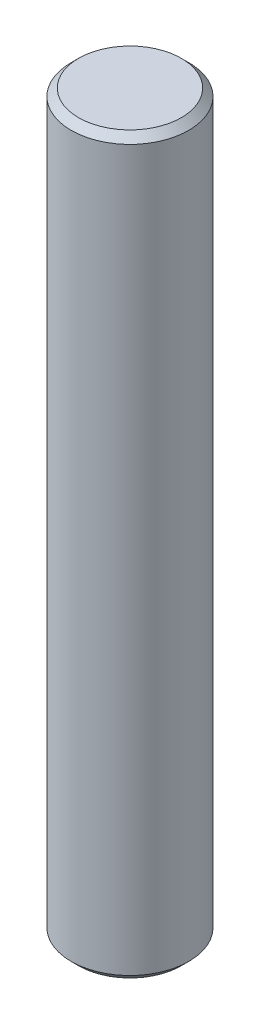
ISO-10303-21;
HEADER;
FILE_DESCRIPTION(('STEP AP214'),'2;1');
FILE_NAME('part.step','',(''),(''),'','','');
FILE_SCHEMA(('AUTOMOTIVE_DESIGN { 1 0 10303 214 1 1 1 1 }'));
ENDSEC;
DATA;
#1=APPLICATION_CONTEXT('core data for automotive mechanical design processes');
#2=APPLICATION_PROTOCOL_DEFINITION('international standard','automotive_design',2000,#1);
#3=PRODUCT_CONTEXT('',#1,'mechanical');
#4=PRODUCT('Part','Part','',(#3));
#5=PRODUCT_RELATED_PRODUCT_CATEGORY('part','',(#4));
#6=PRODUCT_DEFINITION_FORMATION('','',#4);
#7=PRODUCT_DEFINITION_CONTEXT('part definition',#1,'design');
#8=PRODUCT_DEFINITION('design','',#6,#7);
#9=PRODUCT_DEFINITION_SHAPE('','',#8);
#10=(LENGTH_UNIT() NAMED_UNIT(*) SI_UNIT(.MILLI.,.METRE.));
#11=(NAMED_UNIT(*) PLANE_ANGLE_UNIT() SI_UNIT($,.RADIAN.));
#12=(NAMED_UNIT(*) SI_UNIT($,.STERADIAN.) SOLID_ANGLE_UNIT());
#13=UNCERTAINTY_MEASURE_WITH_UNIT(LENGTH_MEASURE(1.E-05),#10,'distance_accuracy_value','');
#14=(GEOMETRIC_REPRESENTATION_CONTEXT(3) GLOBAL_UNCERTAINTY_ASSIGNED_CONTEXT((#13)) GLOBAL_UNIT_ASSIGNED_CONTEXT((#10,
#11,#12)) REPRESENTATION_CONTEXT('',''));
#15=CARTESIAN_POINT('',(0.,0.,0.));
#16=DIRECTION('',(0.,0.,1.));
#17=DIRECTION('',(1.,0.,0.));
#18=AXIS2_PLACEMENT_3D('',#15,#16,#17);
#19=CARTESIAN_POINT('',(0.,50.,0.));
#20=DIRECTION('',(0.,-1.,0.));
#21=DIRECTION('',(0.,0.,-1.));
#22=AXIS2_PLACEMENT_3D('',#19,#20,#21);
#23=CYLINDRICAL_SURFACE('',#22,4.);
#24=CARTESIAN_POINT('',(0.,0.499999999999987,0.));
#25=DIRECTION('',(0.,1.,0.));
#26=DIRECTION('',(0.,0.,1.));
#27=AXIS2_PLACEMENT_3D('',#24,#25,#26);
#28=CIRCLE('',#27,4.);
#29=CARTESIAN_POINT('',(0.,0.499999999999987,4.));
#30=VERTEX_POINT('',#29);
#31=EDGE_CURVE('E41',#30,#30,#28,.T.);
#32=ORIENTED_EDGE('',*,*,#31,.T.);
#33=EDGE_LOOP('',(#32));
#34=FACE_BOUND('',#33,.T.);
#35=CARTESIAN_POINT('',(0.,49.5,0.));
#36=DIRECTION('',(0.,1.,0.));
#37=DIRECTION('',(0.,0.,1.));
#38=AXIS2_PLACEMENT_3D('',#35,#36,#37);
#39=CIRCLE('',#38,4.);
#40=CARTESIAN_POINT('',(0.,49.5,4.));
#41=VERTEX_POINT('',#40);
#42=EDGE_CURVE('E45',#41,#41,#39,.F.);
#43=ORIENTED_EDGE('',*,*,#42,.T.);
#44=EDGE_LOOP('',(#43));
#45=FACE_BOUND('',#44,.T.);
#46=ADVANCED_FACE('F30',(#34,#45),#23,.T.);
#47=CARTESIAN_POINT('',(0.,50.,0.));
#48=DIRECTION('',(0.,1.,0.));
#49=DIRECTION('',(0.,0.,1.));
#50=AXIS2_PLACEMENT_3D('',#47,#48,#49);
#51=PLANE('',#50);
#52=CARTESIAN_POINT('',(0.,50.,0.));
#53=DIRECTION('',(0.,1.,0.));
#54=DIRECTION('',(0.,0.,1.));
#55=AXIS2_PLACEMENT_3D('',#52,#53,#54);
#56=CIRCLE('',#55,3.5);
#57=CARTESIAN_POINT('',(0.,50.,3.5));
#58=VERTEX_POINT('',#57);
#59=EDGE_CURVE('E10',#58,#58,#56,.T.);
#60=ORIENTED_EDGE('',*,*,#59,.T.);
#61=EDGE_LOOP('',(#60));
#62=FACE_BOUND('',#61,.T.);
#63=ADVANCED_FACE('F61',(#62),#51,.T.);
#64=CARTESIAN_POINT('',(0.,0.,0.));
#65=DIRECTION('',(0.,1.,0.));
#66=DIRECTION('',(0.,0.,1.));
#67=AXIS2_PLACEMENT_3D('',#64,#65,#66);
#68=PLANE('',#67);
#69=CARTESIAN_POINT('',(0.,0.,0.));
#70=DIRECTION('',(0.,1.,0.));
#71=DIRECTION('',(0.,0.,1.));
#72=AXIS2_PLACEMENT_3D('',#69,#70,#71);
#73=CIRCLE('',#72,3.50000000000002);
#74=CARTESIAN_POINT('',(0.,0.,3.50000000000002));
#75=VERTEX_POINT('',#74);
#76=EDGE_CURVE('E37',#75,#75,#73,.F.);
#77=ORIENTED_EDGE('',*,*,#76,.T.);
#78=EDGE_LOOP('',(#77));
#79=FACE_BOUND('',#78,.T.);
#80=ADVANCED_FACE('F58',(#79),#68,.F.);
#81=CARTESIAN_POINT('',(0.,0.499999999999987,0.));
#82=DIRECTION('',(0.,1.,0.));
#83=DIRECTION('',(0.,0.,1.));
#84=AXIS2_PLACEMENT_3D('',#81,#82,#83);
#85=CONICAL_SURFACE('',#84,4.,0.785398163397445);
#86=ORIENTED_EDGE('',*,*,#76,.F.);
#87=EDGE_LOOP('',(#86));
#88=FACE_BOUND('',#87,.T.);
#89=ORIENTED_EDGE('',*,*,#31,.F.);
#90=EDGE_LOOP('',(#89));
#91=FACE_BOUND('',#90,.T.);
#92=ADVANCED_FACE('F54',(#88,#91),#85,.T.);
#93=CARTESIAN_POINT('',(0.,50.,0.));
#94=DIRECTION('',(0.,-1.,0.));
#95=DIRECTION('',(0.,0.,-1.));
#96=AXIS2_PLACEMENT_3D('',#93,#94,#95);
#97=CONICAL_SURFACE('',#96,3.5,0.785398163397452);
#98=ORIENTED_EDGE('',*,*,#42,.F.);
#99=EDGE_LOOP('',(#98));
#100=FACE_BOUND('',#99,.T.);
#101=ORIENTED_EDGE('',*,*,#59,.F.);
#102=EDGE_LOOP('',(#101));
#103=FACE_BOUND('',#102,.T.);
#104=ADVANCED_FACE('F32',(#100,#103),#97,.T.);
#105=CLOSED_SHELL('',(#46,#63,#80,#92,#104));
#106=MANIFOLD_SOLID_BREP('B2',#105);
#107=ADVANCED_BREP_SHAPE_REPRESENTATION('',(#18,#106),#14);
#108=SHAPE_DEFINITION_REPRESENTATION(#9,#107);
ENDSEC;
END-ISO-10303-21;
